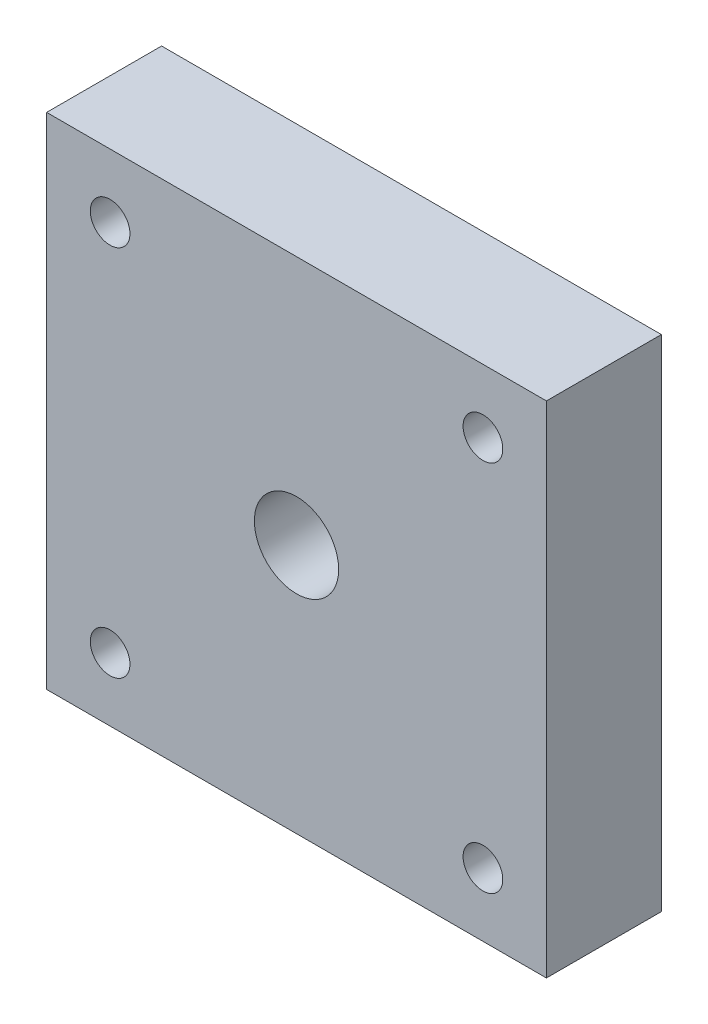
ISO-10303-21;
HEADER;
FILE_DESCRIPTION(('STEP AP214'),'2;1');
FILE_NAME('part.step','',(''),(''),'','','');
FILE_SCHEMA(('AUTOMOTIVE_DESIGN { 1 0 10303 214 1 1 1 1 }'));
ENDSEC;
DATA;
#1=APPLICATION_CONTEXT('core data for automotive mechanical design processes');
#2=APPLICATION_PROTOCOL_DEFINITION('international standard','automotive_design',2000,#1);
#3=PRODUCT_CONTEXT('',#1,'mechanical');
#4=PRODUCT('Part','Part','',(#3));
#5=PRODUCT_RELATED_PRODUCT_CATEGORY('part','',(#4));
#6=PRODUCT_DEFINITION_FORMATION('','',#4);
#7=PRODUCT_DEFINITION_CONTEXT('part definition',#1,'design');
#8=PRODUCT_DEFINITION('design','',#6,#7);
#9=PRODUCT_DEFINITION_SHAPE('','',#8);
#10=(LENGTH_UNIT() NAMED_UNIT(*) SI_UNIT(.MILLI.,.METRE.));
#11=(NAMED_UNIT(*) PLANE_ANGLE_UNIT() SI_UNIT($,.RADIAN.));
#12=(NAMED_UNIT(*) SI_UNIT($,.STERADIAN.) SOLID_ANGLE_UNIT());
#13=UNCERTAINTY_MEASURE_WITH_UNIT(LENGTH_MEASURE(1.E-05),#10,'distance_accuracy_value','');
#14=(GEOMETRIC_REPRESENTATION_CONTEXT(3) GLOBAL_UNCERTAINTY_ASSIGNED_CONTEXT((#13)) GLOBAL_UNIT_ASSIGNED_CONTEXT((#10,
#11,#12)) REPRESENTATION_CONTEXT('',''));
#15=CARTESIAN_POINT('',(0.,0.,0.));
#16=DIRECTION('',(0.,0.,1.));
#17=DIRECTION('',(1.,0.,0.));
#18=AXIS2_PLACEMENT_3D('',#15,#16,#17);
#19=CARTESIAN_POINT('',(-25.,-25.,11.5));
#20=DIRECTION('',(1.,0.,0.));
#21=DIRECTION('',(0.,0.,-1.));
#22=AXIS2_PLACEMENT_3D('',#19,#20,#21);
#23=PLANE('',#22);
#24=DIRECTION('',(0.,-1.,0.));
#25=VECTOR('',#24,1.);
#26=CARTESIAN_POINT('',(-25.,-25.,0.));
#27=LINE('',#26,#25);
#28=CARTESIAN_POINT('',(-25.,25.,0.));
#29=VERTEX_POINT('',#28);
#30=CARTESIAN_POINT('',(-25.,-25.,0.));
#31=VERTEX_POINT('',#30);
#32=EDGE_CURVE('E109',#29,#31,#27,.T.);
#33=ORIENTED_EDGE('',*,*,#32,.T.);
#34=DIRECTION('',(0.,0.,-1.));
#35=VECTOR('',#34,1.);
#36=CARTESIAN_POINT('',(-25.,-25.,11.5));
#37=LINE('',#36,#35);
#38=CARTESIAN_POINT('',(-25.,-25.,11.5));
#39=VERTEX_POINT('',#38);
#40=EDGE_CURVE('E13',#39,#31,#37,.T.);
#41=ORIENTED_EDGE('',*,*,#40,.F.);
#42=DIRECTION('',(0.,-1.,0.));
#43=VECTOR('',#42,1.);
#44=CARTESIAN_POINT('',(-25.,-25.,11.5));
#45=LINE('',#44,#43);
#46=CARTESIAN_POINT('',(-25.,25.,11.5));
#47=VERTEX_POINT('',#46);
#48=EDGE_CURVE('E97',#47,#39,#45,.T.);
#49=ORIENTED_EDGE('',*,*,#48,.F.);
#50=DIRECTION('',(0.,0.,-1.));
#51=VECTOR('',#50,1.);
#52=CARTESIAN_POINT('',(-25.,25.,11.5));
#53=LINE('',#52,#51);
#54=EDGE_CURVE('E105',#47,#29,#53,.T.);
#55=ORIENTED_EDGE('',*,*,#54,.T.);
#56=EDGE_LOOP('',(#33,#41,#49,#55));
#57=FACE_BOUND('',#56,.T.);
#58=ADVANCED_FACE('F46',(#57),#23,.F.);
#59=CARTESIAN_POINT('',(25.,-25.,11.5));
#60=DIRECTION('',(0.,1.,0.));
#61=DIRECTION('',(0.,0.,1.));
#62=AXIS2_PLACEMENT_3D('',#59,#60,#61);
#63=PLANE('',#62);
#64=DIRECTION('',(1.,0.,0.));
#65=VECTOR('',#64,1.);
#66=CARTESIAN_POINT('',(25.,-25.,0.));
#67=LINE('',#66,#65);
#68=CARTESIAN_POINT('',(25.,-25.,0.));
#69=VERTEX_POINT('',#68);
#70=EDGE_CURVE('E101',#31,#69,#67,.T.);
#71=ORIENTED_EDGE('',*,*,#70,.T.);
#72=DIRECTION('',(0.,0.,-1.));
#73=VECTOR('',#72,1.);
#74=CARTESIAN_POINT('',(25.,-25.,11.5));
#75=LINE('',#74,#73);
#76=CARTESIAN_POINT('',(25.,-25.,11.5));
#77=VERTEX_POINT('',#76);
#78=EDGE_CURVE('E54',#77,#69,#75,.T.);
#79=ORIENTED_EDGE('',*,*,#78,.F.);
#80=DIRECTION('',(1.,0.,0.));
#81=VECTOR('',#80,1.);
#82=CARTESIAN_POINT('',(25.,-25.,11.5));
#83=LINE('',#82,#81);
#84=EDGE_CURVE('E92',#39,#77,#83,.T.);
#85=ORIENTED_EDGE('',*,*,#84,.F.);
#86=ORIENTED_EDGE('',*,*,#40,.T.);
#87=EDGE_LOOP('',(#71,#79,#85,#86));
#88=FACE_BOUND('',#87,.T.);
#89=ADVANCED_FACE('F100',(#88),#63,.F.);
#90=CARTESIAN_POINT('',(25.,-25.,11.5));
#91=DIRECTION('',(-1.,0.,0.));
#92=DIRECTION('',(0.,0.,1.));
#93=AXIS2_PLACEMENT_3D('',#90,#91,#92);
#94=PLANE('',#93);
#95=DIRECTION('',(0.,1.,0.));
#96=VECTOR('',#95,1.);
#97=CARTESIAN_POINT('',(25.,-25.,0.));
#98=LINE('',#97,#96);
#99=CARTESIAN_POINT('',(25.,25.,0.));
#100=VERTEX_POINT('',#99);
#101=EDGE_CURVE('E79',#69,#100,#98,.T.);
#102=ORIENTED_EDGE('',*,*,#101,.T.);
#103=DIRECTION('',(0.,0.,-1.));
#104=VECTOR('',#103,1.);
#105=CARTESIAN_POINT('',(25.,25.,11.5));
#106=LINE('',#105,#104);
#107=CARTESIAN_POINT('',(25.,25.,11.5));
#108=VERTEX_POINT('',#107);
#109=EDGE_CURVE('E102',#108,#100,#106,.T.);
#110=ORIENTED_EDGE('',*,*,#109,.F.);
#111=DIRECTION('',(0.,1.,0.));
#112=VECTOR('',#111,1.);
#113=CARTESIAN_POINT('',(25.,-25.,11.5));
#114=LINE('',#113,#112);
#115=EDGE_CURVE('E95',#77,#108,#114,.T.);
#116=ORIENTED_EDGE('',*,*,#115,.F.);
#117=ORIENTED_EDGE('',*,*,#78,.T.);
#118=EDGE_LOOP('',(#102,#110,#116,#117));
#119=FACE_BOUND('',#118,.T.);
#120=ADVANCED_FACE('F103',(#119),#94,.F.);
#121=CARTESIAN_POINT('',(25.,25.,11.5));
#122=DIRECTION('',(0.,-1.,0.));
#123=DIRECTION('',(0.,0.,-1.));
#124=AXIS2_PLACEMENT_3D('',#121,#122,#123);
#125=PLANE('',#124);
#126=DIRECTION('',(-1.,0.,0.));
#127=VECTOR('',#126,1.);
#128=CARTESIAN_POINT('',(25.,25.,0.));
#129=LINE('',#128,#127);
#130=EDGE_CURVE('E85',#100,#29,#129,.T.);
#131=ORIENTED_EDGE('',*,*,#130,.T.);
#132=ORIENTED_EDGE('',*,*,#54,.F.);
#133=DIRECTION('',(-1.,0.,0.));
#134=VECTOR('',#133,1.);
#135=CARTESIAN_POINT('',(25.,25.,11.5));
#136=LINE('',#135,#134);
#137=EDGE_CURVE('E62',#108,#47,#136,.T.);
#138=ORIENTED_EDGE('',*,*,#137,.F.);
#139=ORIENTED_EDGE('',*,*,#109,.T.);
#140=EDGE_LOOP('',(#131,#132,#138,#139));
#141=FACE_BOUND('',#140,.T.);
#142=ADVANCED_FACE('F117',(#141),#125,.F.);
#143=CARTESIAN_POINT('',(0.,0.,11.5));
#144=DIRECTION('',(0.,0.,1.));
#145=DIRECTION('',(1.,0.,0.));
#146=AXIS2_PLACEMENT_3D('',#143,#144,#145);
#147=PLANE('',#146);
#148=CARTESIAN_POINT('',(0.,0.,11.5));
#149=DIRECTION('',(0.,0.,1.));
#150=DIRECTION('',(1.,0.,0.));
#151=AXIS2_PLACEMENT_3D('',#148,#149,#150);
#152=CIRCLE('',#151,4.2164);
#153=CARTESIAN_POINT('',(4.2164,0.,11.5));
#154=VERTEX_POINT('',#153);
#155=EDGE_CURVE('E147',#154,#154,#152,.T.);
#156=ORIENTED_EDGE('',*,*,#155,.F.);
#157=EDGE_LOOP('',(#156));
#158=FACE_BOUND('',#157,.T.);
#159=CARTESIAN_POINT('',(18.65,18.65,11.5));
#160=DIRECTION('',(0.,0.,-1.));
#161=DIRECTION('',(-1.,0.,0.));
#162=AXIS2_PLACEMENT_3D('',#159,#160,#161);
#163=CIRCLE('',#162,1.984375);
#164=CARTESIAN_POINT('',(16.665625,18.65,11.5));
#165=VERTEX_POINT('',#164);
#166=EDGE_CURVE('E141',#165,#165,#163,.T.);
#167=ORIENTED_EDGE('',*,*,#166,.T.);
#168=EDGE_LOOP('',(#167));
#169=FACE_BOUND('',#168,.T.);
#170=CARTESIAN_POINT('',(18.65,-18.65,11.5));
#171=DIRECTION('',(0.,0.,1.));
#172=DIRECTION('',(-1.,0.,0.));
#173=AXIS2_PLACEMENT_3D('',#170,#171,#172);
#174=CIRCLE('',#173,1.984375);
#175=CARTESIAN_POINT('',(16.665625,-18.65,11.5));
#176=VERTEX_POINT('',#175);
#177=EDGE_CURVE('E135',#176,#176,#174,.T.);
#178=ORIENTED_EDGE('',*,*,#177,.F.);
#179=EDGE_LOOP('',(#178));
#180=FACE_BOUND('',#179,.T.);
#181=CARTESIAN_POINT('',(-18.65,-18.65,11.5));
#182=DIRECTION('',(0.,0.,-1.));
#183=DIRECTION('',(1.,0.,0.));
#184=AXIS2_PLACEMENT_3D('',#181,#182,#183);
#185=CIRCLE('',#184,1.984375);
#186=CARTESIAN_POINT('',(-16.665625,-18.65,11.5));
#187=VERTEX_POINT('',#186);
#188=EDGE_CURVE('E129',#187,#187,#185,.T.);
#189=ORIENTED_EDGE('',*,*,#188,.T.);
#190=EDGE_LOOP('',(#189));
#191=FACE_BOUND('',#190,.T.);
#192=CARTESIAN_POINT('',(-18.65,18.65,11.5));
#193=DIRECTION('',(0.,0.,1.));
#194=DIRECTION('',(1.,0.,0.));
#195=AXIS2_PLACEMENT_3D('',#192,#193,#194);
#196=CIRCLE('',#195,1.984375);
#197=CARTESIAN_POINT('',(-16.665625,18.65,11.5));
#198=VERTEX_POINT('',#197);
#199=EDGE_CURVE('E123',#198,#198,#196,.T.);
#200=ORIENTED_EDGE('',*,*,#199,.F.);
#201=EDGE_LOOP('',(#200));
#202=FACE_BOUND('',#201,.T.);
#203=ORIENTED_EDGE('',*,*,#48,.T.);
#204=ORIENTED_EDGE('',*,*,#84,.T.);
#205=ORIENTED_EDGE('',*,*,#115,.T.);
#206=ORIENTED_EDGE('',*,*,#137,.T.);
#207=EDGE_LOOP('',(#203,#204,#205,#206));
#208=FACE_BOUND('',#207,.T.);
#209=ADVANCED_FACE('F93',(#158,#169,#180,#191,#202,#208),#147,.T.);
#210=CARTESIAN_POINT('',(0.,0.,0.));
#211=DIRECTION('',(0.,0.,1.));
#212=DIRECTION('',(1.,0.,0.));
#213=AXIS2_PLACEMENT_3D('',#210,#211,#212);
#214=PLANE('',#213);
#215=CARTESIAN_POINT('',(0.,0.,0.));
#216=DIRECTION('',(0.,0.,1.));
#217=DIRECTION('',(1.,0.,0.));
#218=AXIS2_PLACEMENT_3D('',#215,#216,#217);
#219=CIRCLE('',#218,4.2164);
#220=CARTESIAN_POINT('',(4.2164,0.,0.));
#221=VERTEX_POINT('',#220);
#222=EDGE_CURVE('E144',#221,#221,#219,.T.);
#223=ORIENTED_EDGE('',*,*,#222,.T.);
#224=EDGE_LOOP('',(#223));
#225=FACE_BOUND('',#224,.T.);
#226=CARTESIAN_POINT('',(18.65,18.65,0.));
#227=DIRECTION('',(0.,0.,-1.));
#228=DIRECTION('',(-1.,0.,0.));
#229=AXIS2_PLACEMENT_3D('',#226,#227,#228);
#230=CIRCLE('',#229,1.984375);
#231=CARTESIAN_POINT('',(16.665625,18.65,0.));
#232=VERTEX_POINT('',#231);
#233=EDGE_CURVE('E138',#232,#232,#230,.T.);
#234=ORIENTED_EDGE('',*,*,#233,.F.);
#235=EDGE_LOOP('',(#234));
#236=FACE_BOUND('',#235,.T.);
#237=CARTESIAN_POINT('',(18.65,-18.65,0.));
#238=DIRECTION('',(0.,0.,1.));
#239=DIRECTION('',(-1.,0.,0.));
#240=AXIS2_PLACEMENT_3D('',#237,#238,#239);
#241=CIRCLE('',#240,1.984375);
#242=CARTESIAN_POINT('',(16.665625,-18.65,0.));
#243=VERTEX_POINT('',#242);
#244=EDGE_CURVE('E132',#243,#243,#241,.T.);
#245=ORIENTED_EDGE('',*,*,#244,.T.);
#246=EDGE_LOOP('',(#245));
#247=FACE_BOUND('',#246,.T.);
#248=CARTESIAN_POINT('',(-18.65,-18.65,0.));
#249=DIRECTION('',(0.,0.,-1.));
#250=DIRECTION('',(1.,0.,0.));
#251=AXIS2_PLACEMENT_3D('',#248,#249,#250);
#252=CIRCLE('',#251,1.984375);
#253=CARTESIAN_POINT('',(-16.665625,-18.65,0.));
#254=VERTEX_POINT('',#253);
#255=EDGE_CURVE('E126',#254,#254,#252,.T.);
#256=ORIENTED_EDGE('',*,*,#255,.F.);
#257=EDGE_LOOP('',(#256));
#258=FACE_BOUND('',#257,.T.);
#259=CARTESIAN_POINT('',(-18.65,18.65,0.));
#260=DIRECTION('',(0.,0.,1.));
#261=DIRECTION('',(1.,0.,0.));
#262=AXIS2_PLACEMENT_3D('',#259,#260,#261);
#263=CIRCLE('',#262,1.984375);
#264=CARTESIAN_POINT('',(-16.665625,18.65,0.));
#265=VERTEX_POINT('',#264);
#266=EDGE_CURVE('E112',#265,#265,#263,.T.);
#267=ORIENTED_EDGE('',*,*,#266,.T.);
#268=EDGE_LOOP('',(#267));
#269=FACE_BOUND('',#268,.T.);
#270=ORIENTED_EDGE('',*,*,#32,.F.);
#271=ORIENTED_EDGE('',*,*,#130,.F.);
#272=ORIENTED_EDGE('',*,*,#101,.F.);
#273=ORIENTED_EDGE('',*,*,#70,.F.);
#274=EDGE_LOOP('',(#270,#271,#272,#273));
#275=FACE_BOUND('',#274,.T.);
#276=ADVANCED_FACE('F120',(#225,#236,#247,#258,#269,#275),#214,.F.);
#277=CARTESIAN_POINT('',(-18.65,18.65,0.));
#278=DIRECTION('',(0.,0.,1.));
#279=DIRECTION('',(1.,0.,0.));
#280=AXIS2_PLACEMENT_3D('',#277,#278,#279);
#281=CYLINDRICAL_SURFACE('',#280,1.984375);
#282=ORIENTED_EDGE('',*,*,#266,.F.);
#283=EDGE_LOOP('',(#282));
#284=FACE_BOUND('',#283,.T.);
#285=ORIENTED_EDGE('',*,*,#199,.T.);
#286=EDGE_LOOP('',(#285));
#287=FACE_BOUND('',#286,.T.);
#288=ADVANCED_FACE('F173',(#284,#287),#281,.F.);
#289=CARTESIAN_POINT('',(-18.65,-18.65,0.));
#290=DIRECTION('',(0.,0.,1.));
#291=DIRECTION('',(1.,0.,0.));
#292=AXIS2_PLACEMENT_3D('',#289,#290,#291);
#293=CYLINDRICAL_SURFACE('',#292,1.984375);
#294=ORIENTED_EDGE('',*,*,#255,.T.);
#295=EDGE_LOOP('',(#294));
#296=FACE_BOUND('',#295,.T.);
#297=ORIENTED_EDGE('',*,*,#188,.F.);
#298=EDGE_LOOP('',(#297));
#299=FACE_BOUND('',#298,.T.);
#300=ADVANCED_FACE('F175',(#296,#299),#293,.F.);
#301=CARTESIAN_POINT('',(18.65,-18.65,0.));
#302=DIRECTION('',(0.,0.,1.));
#303=DIRECTION('',(1.,0.,0.));
#304=AXIS2_PLACEMENT_3D('',#301,#302,#303);
#305=CYLINDRICAL_SURFACE('',#304,1.984375);
#306=ORIENTED_EDGE('',*,*,#244,.F.);
#307=EDGE_LOOP('',(#306));
#308=FACE_BOUND('',#307,.T.);
#309=ORIENTED_EDGE('',*,*,#177,.T.);
#310=EDGE_LOOP('',(#309));
#311=FACE_BOUND('',#310,.T.);
#312=ADVANCED_FACE('F182',(#308,#311),#305,.F.);
#313=CARTESIAN_POINT('',(18.65,18.65,0.));
#314=DIRECTION('',(0.,0.,1.));
#315=DIRECTION('',(1.,0.,0.));
#316=AXIS2_PLACEMENT_3D('',#313,#314,#315);
#317=CYLINDRICAL_SURFACE('',#316,1.984375);
#318=ORIENTED_EDGE('',*,*,#233,.T.);
#319=EDGE_LOOP('',(#318));
#320=FACE_BOUND('',#319,.T.);
#321=ORIENTED_EDGE('',*,*,#166,.F.);
#322=EDGE_LOOP('',(#321));
#323=FACE_BOUND('',#322,.T.);
#324=ADVANCED_FACE('F158',(#320,#323),#317,.F.);
#325=CARTESIAN_POINT('',(0.,0.,0.));
#326=DIRECTION('',(0.,0.,1.));
#327=DIRECTION('',(1.,0.,0.));
#328=AXIS2_PLACEMENT_3D('',#325,#326,#327);
#329=CYLINDRICAL_SURFACE('',#328,4.2164);
#330=ORIENTED_EDGE('',*,*,#222,.F.);
#331=EDGE_LOOP('',(#330));
#332=FACE_BOUND('',#331,.T.);
#333=ORIENTED_EDGE('',*,*,#155,.T.);
#334=EDGE_LOOP('',(#333));
#335=FACE_BOUND('',#334,.T.);
#336=ADVANCED_FACE('F155',(#332,#335),#329,.F.);
#337=CLOSED_SHELL('',(#58,#89,#120,#142,#209,#276,#288,#300,#312,#324,#336));
#338=MANIFOLD_SOLID_BREP('B2',#337);
#339=ADVANCED_BREP_SHAPE_REPRESENTATION('',(#18,#338),#14);
#340=SHAPE_DEFINITION_REPRESENTATION(#9,#339);
ENDSEC;
END-ISO-10303-21;
